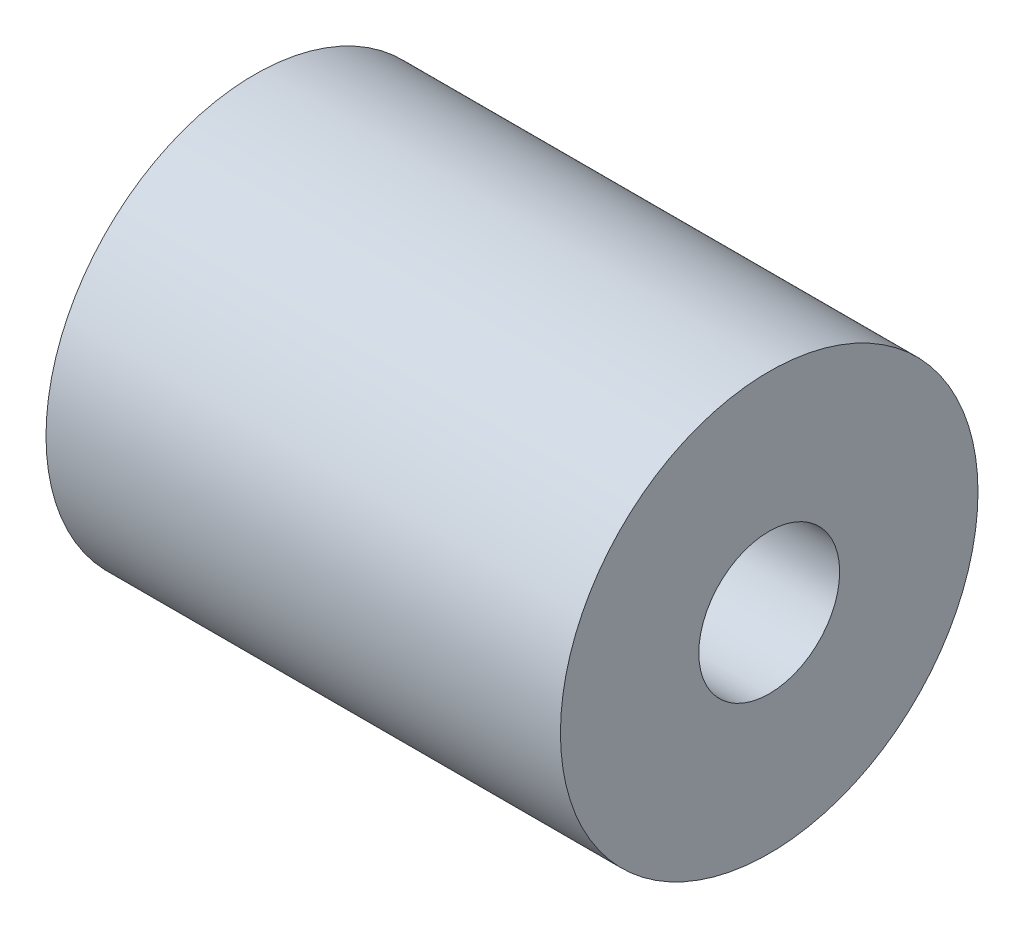
ISO-10303-21;
HEADER;
FILE_DESCRIPTION(('STEP AP214'),'2;1');
FILE_NAME('part.step','',(''),(''),'','','');
FILE_SCHEMA(('AUTOMOTIVE_DESIGN { 1 0 10303 214 1 1 1 1 }'));
ENDSEC;
DATA;
#1=APPLICATION_CONTEXT('core data for automotive mechanical design processes');
#2=APPLICATION_PROTOCOL_DEFINITION('international standard','automotive_design',2000,#1);
#3=PRODUCT_CONTEXT('',#1,'mechanical');
#4=PRODUCT('Part','Part','',(#3));
#5=PRODUCT_RELATED_PRODUCT_CATEGORY('part','',(#4));
#6=PRODUCT_DEFINITION_FORMATION('','',#4);
#7=PRODUCT_DEFINITION_CONTEXT('part definition',#1,'design');
#8=PRODUCT_DEFINITION('design','',#6,#7);
#9=PRODUCT_DEFINITION_SHAPE('','',#8);
#10=(LENGTH_UNIT() NAMED_UNIT(*) SI_UNIT(.MILLI.,.METRE.));
#11=(NAMED_UNIT(*) PLANE_ANGLE_UNIT() SI_UNIT($,.RADIAN.));
#12=(NAMED_UNIT(*) SI_UNIT($,.STERADIAN.) SOLID_ANGLE_UNIT());
#13=UNCERTAINTY_MEASURE_WITH_UNIT(LENGTH_MEASURE(1.E-05),#10,'distance_accuracy_value','');
#14=(GEOMETRIC_REPRESENTATION_CONTEXT(3) GLOBAL_UNCERTAINTY_ASSIGNED_CONTEXT((#13)) GLOBAL_UNIT_ASSIGNED_CONTEXT((#10,
#11,#12)) REPRESENTATION_CONTEXT('',''));
#15=CARTESIAN_POINT('',(0.,0.,0.));
#16=DIRECTION('',(0.,0.,1.));
#17=DIRECTION('',(1.,0.,0.));
#18=AXIS2_PLACEMENT_3D('',#15,#16,#17);
#19=CARTESIAN_POINT('',(-15.4,0.,0.));
#20=DIRECTION('',(1.,0.,0.));
#21=DIRECTION('',(0.,0.,-1.));
#22=AXIS2_PLACEMENT_3D('',#19,#20,#21);
#23=CYLINDRICAL_SURFACE('',#22,12.5);
#24=CARTESIAN_POINT('',(-15.4,0.,0.));
#25=DIRECTION('',(1.,0.,0.));
#26=DIRECTION('',(0.,0.,-1.));
#27=AXIS2_PLACEMENT_3D('',#24,#25,#26);
#28=CIRCLE('',#27,12.5);
#29=CARTESIAN_POINT('',(-15.4,0.,-12.5));
#30=VERTEX_POINT('',#29);
#31=EDGE_CURVE('E10',#30,#30,#28,.T.);
#32=ORIENTED_EDGE('',*,*,#31,.T.);
#33=EDGE_LOOP('',(#32));
#34=FACE_BOUND('',#33,.T.);
#35=CARTESIAN_POINT('',(15.4,0.,0.));
#36=DIRECTION('',(1.,0.,0.));
#37=DIRECTION('',(0.,0.,-1.));
#38=AXIS2_PLACEMENT_3D('',#35,#36,#37);
#39=CIRCLE('',#38,12.5);
#40=CARTESIAN_POINT('',(15.4,0.,-12.5));
#41=VERTEX_POINT('',#40);
#42=EDGE_CURVE('E43',#41,#41,#39,.T.);
#43=ORIENTED_EDGE('',*,*,#42,.F.);
#44=EDGE_LOOP('',(#43));
#45=FACE_BOUND('',#44,.T.);
#46=ADVANCED_FACE('F37',(#34,#45),#23,.T.);
#47=CARTESIAN_POINT('',(-15.4,0.,0.));
#48=DIRECTION('',(1.,0.,0.));
#49=DIRECTION('',(0.,0.,-1.));
#50=AXIS2_PLACEMENT_3D('',#47,#48,#49);
#51=PLANE('',#50);
#52=CARTESIAN_POINT('',(-15.4,0.,0.));
#53=DIRECTION('',(-1.,0.,0.));
#54=DIRECTION('',(0.,0.,1.));
#55=AXIS2_PLACEMENT_3D('',#52,#53,#54);
#56=CIRCLE('',#55,4.21639999999999);
#57=CARTESIAN_POINT('',(-15.4,0.,4.21639999999999));
#58=VERTEX_POINT('',#57);
#59=EDGE_CURVE('E47',#58,#58,#56,.T.);
#60=ORIENTED_EDGE('',*,*,#59,.F.);
#61=EDGE_LOOP('',(#60));
#62=FACE_BOUND('',#61,.T.);
#63=ORIENTED_EDGE('',*,*,#31,.F.);
#64=EDGE_LOOP('',(#63));
#65=FACE_BOUND('',#64,.T.);
#66=ADVANCED_FACE('F61',(#62,#65),#51,.F.);
#67=CARTESIAN_POINT('',(15.4,0.,0.));
#68=DIRECTION('',(1.,0.,0.));
#69=DIRECTION('',(0.,0.,-1.));
#70=AXIS2_PLACEMENT_3D('',#67,#68,#69);
#71=PLANE('',#70);
#72=CARTESIAN_POINT('',(15.4,0.,0.));
#73=DIRECTION('',(1.,0.,0.));
#74=DIRECTION('',(0.,0.,-1.));
#75=AXIS2_PLACEMENT_3D('',#72,#73,#74);
#76=CIRCLE('',#75,4.21639999999999);
#77=CARTESIAN_POINT('',(15.4,0.,-4.21639999999999));
#78=VERTEX_POINT('',#77);
#79=EDGE_CURVE('E51',#78,#78,#76,.T.);
#80=ORIENTED_EDGE('',*,*,#79,.F.);
#81=EDGE_LOOP('',(#80));
#82=FACE_BOUND('',#81,.T.);
#83=ORIENTED_EDGE('',*,*,#42,.T.);
#84=EDGE_LOOP('',(#83));
#85=FACE_BOUND('',#84,.T.);
#86=ADVANCED_FACE('F59',(#82,#85),#71,.T.);
#87=CARTESIAN_POINT('',(-15.4,0.,0.));
#88=DIRECTION('',(-1.,0.,0.));
#89=DIRECTION('',(0.,0.,1.));
#90=AXIS2_PLACEMENT_3D('',#87,#88,#89);
#91=CYLINDRICAL_SURFACE('',#90,4.21639999999999);
#92=ORIENTED_EDGE('',*,*,#59,.T.);
#93=EDGE_LOOP('',(#92));
#94=FACE_BOUND('',#93,.T.);
#95=ORIENTED_EDGE('',*,*,#79,.T.);
#96=EDGE_LOOP('',(#95));
#97=FACE_BOUND('',#96,.T.);
#98=ADVANCED_FACE('F57',(#94,#97),#91,.F.);
#99=CLOSED_SHELL('',(#46,#66,#86,#98));
#100=MANIFOLD_SOLID_BREP('B2',#99);
#101=ADVANCED_BREP_SHAPE_REPRESENTATION('',(#18,#100),#14);
#102=SHAPE_DEFINITION_REPRESENTATION(#9,#101);
ENDSEC;
END-ISO-10303-21;
